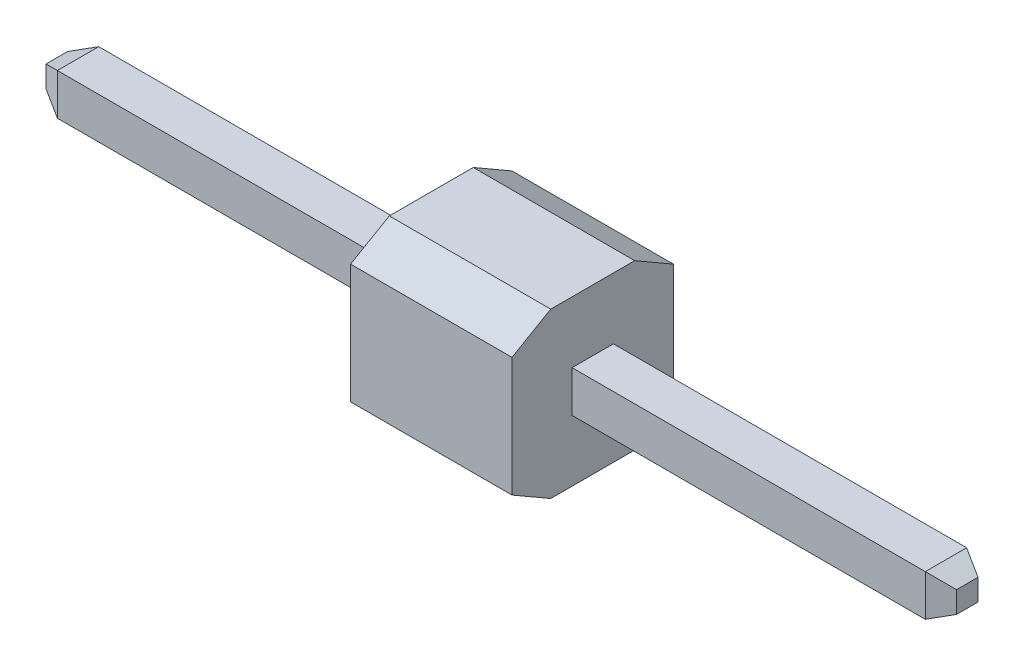
ISO-10303-21;
HEADER;
FILE_DESCRIPTION(('STEP AP214'),'2;1');
FILE_NAME('part.step','',(''),(''),'','','');
FILE_SCHEMA(('AUTOMOTIVE_DESIGN { 1 0 10303 214 1 1 1 1 }'));
ENDSEC;
DATA;
#1=APPLICATION_CONTEXT('core data for automotive mechanical design processes');
#2=APPLICATION_PROTOCOL_DEFINITION('international standard','automotive_design',2000,#1);
#3=PRODUCT_CONTEXT('',#1,'mechanical');
#4=PRODUCT('Part','Part','',(#3));
#5=PRODUCT_RELATED_PRODUCT_CATEGORY('part','',(#4));
#6=PRODUCT_DEFINITION_FORMATION('','',#4);
#7=PRODUCT_DEFINITION_CONTEXT('part definition',#1,'design');
#8=PRODUCT_DEFINITION('design','',#6,#7);
#9=PRODUCT_DEFINITION_SHAPE('','',#8);
#10=(LENGTH_UNIT() NAMED_UNIT(*) SI_UNIT(.MILLI.,.METRE.));
#11=(NAMED_UNIT(*) PLANE_ANGLE_UNIT() SI_UNIT($,.RADIAN.));
#12=(NAMED_UNIT(*) SI_UNIT($,.STERADIAN.) SOLID_ANGLE_UNIT());
#13=UNCERTAINTY_MEASURE_WITH_UNIT(LENGTH_MEASURE(1.E-05),#10,'distance_accuracy_value','');
#14=(GEOMETRIC_REPRESENTATION_CONTEXT(3) GLOBAL_UNCERTAINTY_ASSIGNED_CONTEXT((#13)) GLOBAL_UNIT_ASSIGNED_CONTEXT((#10,
#11,#12)) REPRESENTATION_CONTEXT('',''));
#15=CARTESIAN_POINT('',(0.,0.,0.));
#16=DIRECTION('',(0.,0.,1.));
#17=DIRECTION('',(1.,0.,0.));
#18=AXIS2_PLACEMENT_3D('',#15,#16,#17);
#19=CARTESIAN_POINT('',(5.42104959487915,12.3828717370861,0.629998634255617));
#20=DIRECTION('',(1.,4.37113882867379E-08,-4.37113882867379E-08));
#21=DIRECTION('',(-4.37113882867379E-08,1.,0.));
#22=AXIS2_PLACEMENT_3D('',#19,#20,#21);
#23=PLANE('',#22);
#24=DIRECTION('',(1.59994790123753E-08,0.50000000000019,0.866025403784329));
#25=VECTOR('',#24,1.);
#26=CARTESIAN_POINT('',(5.42104947189323,13.6264615755721,-0.940001365744382));
#27=LINE('',#26,#25);
#28=CARTESIAN_POINT('',(5.42104947189323,13.6264615755721,-0.940001365744382));
#29=VERTEX_POINT('',#28);
#30=CARTESIAN_POINT('',(5.421049482978,13.9728717370861,-0.340001365744383));
#31=VERTEX_POINT('',#30);
#32=EDGE_CURVE('E11',#29,#31,#27,.T.);
#33=ORIENTED_EDGE('',*,*,#32,.T.);
#34=DIRECTION('',(4.37113886966664E-08,0.,0.999999999999999));
#35=VECTOR('',#34,1.);
#36=CARTESIAN_POINT('',(5.421049482978,13.9728717370861,-0.340001365744383));
#37=LINE('',#36,#35);
#38=CARTESIAN_POINT('',(5.4210495398028,13.9728717370861,0.959998634255618));
#39=VERTEX_POINT('',#38);
#40=EDGE_CURVE('E304',#31,#39,#37,.T.);
#41=ORIENTED_EDGE('',*,*,#40,.T.);
#42=DIRECTION('',(5.97108656004285E-08,-0.500000000000188,0.866025403784328));
#43=VECTOR('',#42,1.);
#44=CARTESIAN_POINT('',(5.4210495398028,13.9728717370861,0.959998634255618));
#45=LINE('',#44,#43);
#46=CARTESIAN_POINT('',(5.4210495811717,13.6264615755721,1.55999863425562));
#47=VERTEX_POINT('',#46);
#48=EDGE_CURVE('E296',#39,#47,#45,.T.);
#49=ORIENTED_EDGE('',*,*,#48,.T.);
#50=DIRECTION('',(4.37113884815071E-08,-0.999999999999999,0.));
#51=VECTOR('',#50,1.);
#52=CARTESIAN_POINT('',(5.4210495811717,13.6264615755721,1.55999863425562));
#53=LINE('',#52,#51);
#54=CARTESIAN_POINT('',(5.42104966191449,11.7792818986001,1.55999863425562));
#55=VERTEX_POINT('',#54);
#56=EDGE_CURVE('E281',#47,#55,#53,.T.);
#57=ORIENTED_EDGE('',*,*,#56,.T.);
#58=DIRECTION('',(1.59994777304001E-08,0.50000000000019,0.866025403784329));
#59=VECTOR('',#58,1.);
#60=CARTESIAN_POINT('',(5.42104965082973,11.4328717370861,0.959998634255618));
#61=LINE('',#60,#59);
#62=CARTESIAN_POINT('',(5.42104965082973,11.4328717370861,0.959998634255618));
#63=VERTEX_POINT('',#62);
#64=EDGE_CURVE('E265',#63,#55,#61,.T.);
#65=ORIENTED_EDGE('',*,*,#64,.F.);
#66=DIRECTION('',(4.37113886966664E-08,0.,0.999999999999999));
#67=VECTOR('',#66,1.);
#68=CARTESIAN_POINT('',(5.42104959400492,11.4328717370861,-0.340001365744383));
#69=LINE('',#68,#67);
#70=CARTESIAN_POINT('',(5.42104959400492,11.4328717370861,-0.340001365744383));
#71=VERTEX_POINT('',#70);
#72=EDGE_CURVE('E248',#71,#63,#69,.T.);
#73=ORIENTED_EDGE('',*,*,#72,.F.);
#74=DIRECTION('',(5.97108668824036E-08,-0.500000000000188,0.866025403784328));
#75=VECTOR('',#74,1.);
#76=CARTESIAN_POINT('',(5.42104955263602,11.7792818986001,-0.940001365744382));
#77=LINE('',#76,#75);
#78=CARTESIAN_POINT('',(5.42104955263602,11.7792818986001,-0.940001365744382));
#79=VERTEX_POINT('',#78);
#80=EDGE_CURVE('E242',#79,#71,#77,.T.);
#81=ORIENTED_EDGE('',*,*,#80,.F.);
#82=DIRECTION('',(4.37113884815071E-08,-0.999999999999999,0.));
#83=VECTOR('',#82,1.);
#84=CARTESIAN_POINT('',(5.42104947189323,13.6264615755721,-0.940001365744382));
#85=LINE('',#84,#83);
#86=EDGE_CURVE('E236',#29,#79,#85,.T.);
#87=ORIENTED_EDGE('',*,*,#86,.F.);
#88=EDGE_LOOP('',(#33,#41,#49,#57,#65,#73,#81,#87));
#89=FACE_BOUND('',#88,.T.);
#90=DIRECTION('',(-4.37113900630947E-08,0.,-0.999999999999999));
#91=VECTOR('',#90,1.);
#92=CARTESIAN_POINT('',(5.42104956690386,13.0228717370861,0.629998634255617));
#93=LINE('',#92,#91);
#94=CARTESIAN_POINT('',(5.42104956690386,13.0228717370861,0.629998634255617));
#95=VERTEX_POINT('',#94);
#96=CARTESIAN_POINT('',(5.42104953892857,13.0228717370861,-0.0100013657443826));
#97=VERTEX_POINT('',#96);
#98=EDGE_CURVE('E302',#95,#97,#93,.T.);
#99=ORIENTED_EDGE('',*,*,#98,.T.);
#100=DIRECTION('',(-4.37113900630947E-08,0.999999999999999,0.));
#101=VECTOR('',#100,1.);
#102=CARTESIAN_POINT('',(5.42104956690386,12.3828717370861,-0.0100013657443826));
#103=LINE('',#102,#101);
#104=CARTESIAN_POINT('',(5.42104956690386,12.3828717370861,-0.0100013657443826));
#105=VERTEX_POINT('',#104);
#106=EDGE_CURVE('E293',#105,#97,#103,.T.);
#107=ORIENTED_EDGE('',*,*,#106,.F.);
#108=DIRECTION('',(-4.37113872875372E-08,0.,-0.999999999999999));
#109=VECTOR('',#108,1.);
#110=CARTESIAN_POINT('',(5.42104959487915,12.3828717370861,0.629998634255617));
#111=LINE('',#110,#109);
#112=CARTESIAN_POINT('',(5.42104959487915,12.3828717370861,0.629998634255617));
#113=VERTEX_POINT('',#112);
#114=EDGE_CURVE('E278',#113,#105,#111,.T.);
#115=ORIENTED_EDGE('',*,*,#114,.F.);
#116=DIRECTION('',(-4.37113872875371E-08,0.999999999999999,0.));
#117=VECTOR('',#116,1.);
#118=CARTESIAN_POINT('',(5.42104959487915,12.3828717370861,0.629998634255617));
#119=LINE('',#118,#117);
#120=EDGE_CURVE('E263',#113,#95,#119,.T.);
#121=ORIENTED_EDGE('',*,*,#120,.T.);
#122=EDGE_LOOP('',(#99,#107,#115,#121));
#123=FACE_BOUND('',#122,.T.);
#124=ADVANCED_FACE('F17',(#89,#123),#23,.T.);
#125=CARTESIAN_POINT('',(2.92104959487915,12.3828716278076,0.629998743534088));
#126=DIRECTION('',(1.,4.37113882867379E-08,-4.37113882867379E-08));
#127=DIRECTION('',(-4.37113882867379E-08,1.,0.));
#128=AXIS2_PLACEMENT_3D('',#125,#126,#127);
#129=PLANE('',#128);
#130=DIRECTION('',(1.59994783713877E-08,0.50000000000019,0.866025403784329));
#131=VECTOR('',#130,1.);
#132=CARTESIAN_POINT('',(2.92104947189323,13.6264614662936,-0.940001256465912));
#133=LINE('',#132,#131);
#134=CARTESIAN_POINT('',(2.92104947189323,13.6264614662936,-0.940001256465912));
#135=VERTEX_POINT('',#134);
#136=CARTESIAN_POINT('',(2.921049482978,13.9728716278076,-0.340001256465912));
#137=VERTEX_POINT('',#136);
#138=EDGE_CURVE('E24',#135,#137,#133,.T.);
#139=ORIENTED_EDGE('',*,*,#138,.F.);
#140=DIRECTION('',(4.37113882410924E-08,-0.999999999999999,0.));
#141=VECTOR('',#140,1.);
#142=CARTESIAN_POINT('',(2.92104947189323,13.6264614662936,-0.940001256465912));
#143=LINE('',#142,#141);
#144=CARTESIAN_POINT('',(2.92104955263602,11.7792817893216,-0.940001256465912));
#145=VERTEX_POINT('',#144);
#146=EDGE_CURVE('E300',#135,#145,#143,.T.);
#147=ORIENTED_EDGE('',*,*,#146,.T.);
#148=DIRECTION('',(5.97108668824036E-08,-0.500000000000188,0.866025403784328));
#149=VECTOR('',#148,1.);
#150=CARTESIAN_POINT('',(2.92104955263602,11.7792817893216,-0.940001256465912));
#151=LINE('',#150,#149);
#152=CARTESIAN_POINT('',(2.92104959400492,11.4328716278076,-0.340001256465912));
#153=VERTEX_POINT('',#152);
#154=EDGE_CURVE('E286',#145,#153,#151,.T.);
#155=ORIENTED_EDGE('',*,*,#154,.T.);
#156=DIRECTION('',(4.37113883550593E-08,0.,0.999999999999999));
#157=VECTOR('',#156,1.);
#158=CARTESIAN_POINT('',(2.92104959400492,11.4328716278076,-0.340001256465912));
#159=LINE('',#158,#157);
#160=CARTESIAN_POINT('',(2.92104965082973,11.4328716278076,0.959998743534088));
#161=VERTEX_POINT('',#160);
#162=EDGE_CURVE('E271',#153,#161,#159,.T.);
#163=ORIENTED_EDGE('',*,*,#162,.T.);
#164=DIRECTION('',(1.59994783713877E-08,0.50000000000019,0.866025403784329));
#165=VECTOR('',#164,1.);
#166=CARTESIAN_POINT('',(2.92104965082973,11.4328716278076,0.959998743534088));
#167=LINE('',#166,#165);
#168=CARTESIAN_POINT('',(2.92104966191449,11.7792817893216,1.55999874353409));
#169=VERTEX_POINT('',#168);
#170=EDGE_CURVE('E253',#161,#169,#167,.T.);
#171=ORIENTED_EDGE('',*,*,#170,.T.);
#172=DIRECTION('',(4.37113882410924E-08,-0.999999999999999,0.));
#173=VECTOR('',#172,1.);
#174=CARTESIAN_POINT('',(2.9210495811717,13.6264614662936,1.55999874353409));
#175=LINE('',#174,#173);
#176=CARTESIAN_POINT('',(2.9210495811717,13.6264614662936,1.55999874353409));
#177=VERTEX_POINT('',#176);
#178=EDGE_CURVE('E261',#177,#169,#175,.T.);
#179=ORIENTED_EDGE('',*,*,#178,.F.);
#180=DIRECTION('',(5.97108668824036E-08,-0.500000000000188,0.866025403784328));
#181=VECTOR('',#180,1.);
#182=CARTESIAN_POINT('',(2.9210495398028,13.9728716278076,0.959998743534088));
#183=LINE('',#182,#181);
#184=CARTESIAN_POINT('',(2.9210495398028,13.9728716278076,0.959998743534088));
#185=VERTEX_POINT('',#184);
#186=EDGE_CURVE('E276',#185,#177,#183,.T.);
#187=ORIENTED_EDGE('',*,*,#186,.F.);
#188=DIRECTION('',(4.37113883550593E-08,0.,0.999999999999999));
#189=VECTOR('',#188,1.);
#190=CARTESIAN_POINT('',(2.921049482978,13.9728716278076,-0.340001256465912));
#191=LINE('',#190,#189);
#192=EDGE_CURVE('E291',#137,#185,#191,.T.);
#193=ORIENTED_EDGE('',*,*,#192,.F.);
#194=EDGE_LOOP('',(#139,#147,#155,#163,#171,#179,#187,#193));
#195=FACE_BOUND('',#194,.T.);
#196=DIRECTION('',(-4.37113886753159E-08,0.999999999999999,0.));
#197=VECTOR('',#196,1.);
#198=CARTESIAN_POINT('',(2.92104956690386,12.3828716278076,-0.0100012564659119));
#199=LINE('',#198,#197);
#200=CARTESIAN_POINT('',(2.92104956690386,12.3828716278076,-0.0100012564659119));
#201=VERTEX_POINT('',#200);
#202=CARTESIAN_POINT('',(2.92104953892857,13.0228716278076,-0.0100012564659119));
#203=VERTEX_POINT('',#202);
#204=EDGE_CURVE('E298',#201,#203,#199,.T.);
#205=ORIENTED_EDGE('',*,*,#204,.T.);
#206=DIRECTION('',(-4.37113886753159E-08,0.,-0.999999999999999));
#207=VECTOR('',#206,1.);
#208=CARTESIAN_POINT('',(2.92104956690386,13.0228716278076,0.629998743534088));
#209=LINE('',#208,#207);
#210=CARTESIAN_POINT('',(2.92104956690386,13.0228716278076,0.629998743534088));
#211=VERTEX_POINT('',#210);
#212=EDGE_CURVE('E283',#211,#203,#209,.T.);
#213=ORIENTED_EDGE('',*,*,#212,.F.);
#214=DIRECTION('',(-4.37113879814265E-08,0.999999999999999,0.));
#215=VECTOR('',#214,1.);
#216=CARTESIAN_POINT('',(2.92104959487915,12.3828716278076,0.629998743534088));
#217=LINE('',#216,#215);
#218=CARTESIAN_POINT('',(2.92104959487915,12.3828716278076,0.629998743534088));
#219=VERTEX_POINT('',#218);
#220=EDGE_CURVE('E268',#219,#211,#217,.T.);
#221=ORIENTED_EDGE('',*,*,#220,.F.);
#222=DIRECTION('',(-4.37113879814266E-08,0.,-0.999999999999999));
#223=VECTOR('',#222,1.);
#224=CARTESIAN_POINT('',(2.92104959487915,12.3828716278076,0.629998743534088));
#225=LINE('',#224,#223);
#226=EDGE_CURVE('E251',#219,#201,#225,.T.);
#227=ORIENTED_EDGE('',*,*,#226,.T.);
#228=EDGE_LOOP('',(#205,#213,#221,#227));
#229=FACE_BOUND('',#228,.T.);
#230=ADVANCED_FACE('F314',(#195,#229),#129,.F.);
#231=CARTESIAN_POINT('',(5.42104947189323,13.6264615755721,-0.940001365744382));
#232=DIRECTION('',(5.97108668343731E-08,-0.866025403784328,0.50000000000019));
#233=DIRECTION('',(-1.59994785476185E-08,-0.500000000000192,-0.866025403784329));
#234=AXIS2_PLACEMENT_3D('',#231,#232,#233);
#235=PLANE('',#234);
#236=ORIENTED_EDGE('',*,*,#138,.T.);
#237=DIRECTION('',(-0.999999999999998,-4.37113882867378E-08,4.37113883755557E-08));
#238=VECTOR('',#237,1.);
#239=CARTESIAN_POINT('',(5.421049482978,13.9728717370861,-0.340001365744383));
#240=LINE('',#239,#238);
#241=EDGE_CURVE('E288',#31,#137,#240,.T.);
#242=ORIENTED_EDGE('',*,*,#241,.F.);
#243=ORIENTED_EDGE('',*,*,#32,.F.);
#244=DIRECTION('',(-0.999999999999998,-4.37113882867378E-08,4.37113881091022E-08));
#245=VECTOR('',#244,1.);
#246=CARTESIAN_POINT('',(5.42104947189323,13.6264615755721,-0.940001365744382));
#247=LINE('',#246,#245);
#248=EDGE_CURVE('E256',#29,#135,#247,.T.);
#249=ORIENTED_EDGE('',*,*,#248,.T.);
#250=EDGE_LOOP('',(#236,#242,#243,#249));
#251=FACE_BOUND('',#250,.T.);
#252=ADVANCED_FACE('F306',(#251),#235,.F.);
#253=CARTESIAN_POINT('',(5.421049482978,13.9728717370861,-0.340001365744383));
#254=DIRECTION('',(4.37113882867379E-08,-1.,0.));
#255=DIRECTION('',(1.,4.37113882867379E-08,-4.37113882867379E-08));
#256=AXIS2_PLACEMENT_3D('',#253,#254,#255);
#257=PLANE('',#256);
#258=ORIENTED_EDGE('',*,*,#192,.T.);
#259=DIRECTION('',(-0.999999999999998,-4.37113882867378E-08,4.37113882867378E-08));
#260=VECTOR('',#259,1.);
#261=CARTESIAN_POINT('',(5.4210495398028,13.9728717370861,0.959998634255618));
#262=LINE('',#261,#260);
#263=EDGE_CURVE('E273',#39,#185,#262,.T.);
#264=ORIENTED_EDGE('',*,*,#263,.F.);
#265=ORIENTED_EDGE('',*,*,#40,.F.);
#266=ORIENTED_EDGE('',*,*,#241,.T.);
#267=EDGE_LOOP('',(#258,#264,#265,#266));
#268=FACE_BOUND('',#267,.T.);
#269=ADVANCED_FACE('F311',(#268),#257,.F.);
#270=CARTESIAN_POINT('',(5.4210495398028,13.9728717370861,0.959998634255618));
#271=DIRECTION('',(1.59994785476185E-08,-0.86602540378433,-0.50000000000019));
#272=DIRECTION('',(-5.97108668343731E-08,0.500000000000188,-0.866025403784329));
#273=AXIS2_PLACEMENT_3D('',#270,#271,#272);
#274=PLANE('',#273);
#275=ORIENTED_EDGE('',*,*,#186,.T.);
#276=DIRECTION('',(-0.999999999999998,-4.37113882867378E-08,4.37113882867378E-08));
#277=VECTOR('',#276,1.);
#278=CARTESIAN_POINT('',(5.4210495811717,13.6264615755721,1.55999863425562));
#279=LINE('',#278,#277);
#280=EDGE_CURVE('E258',#47,#177,#279,.T.);
#281=ORIENTED_EDGE('',*,*,#280,.F.);
#282=ORIENTED_EDGE('',*,*,#48,.F.);
#283=ORIENTED_EDGE('',*,*,#263,.T.);
#284=EDGE_LOOP('',(#275,#281,#282,#283));
#285=FACE_BOUND('',#284,.T.);
#286=ADVANCED_FACE('F319',(#285),#274,.F.);
#287=CARTESIAN_POINT('',(5.4210495811717,13.6264615755721,1.55999863425562));
#288=DIRECTION('',(-4.37113882867379E-08,0.,-1.));
#289=DIRECTION('',(-1.,-4.37113882867379E-08,4.37113882867379E-08));
#290=AXIS2_PLACEMENT_3D('',#287,#288,#289);
#291=PLANE('',#290);
#292=ORIENTED_EDGE('',*,*,#178,.T.);
#293=DIRECTION('',(-0.999999999999998,-4.37113882867378E-08,4.37113882867378E-08));
#294=VECTOR('',#293,1.);
#295=CARTESIAN_POINT('',(5.42104966191449,11.7792818986001,1.55999863425562));
#296=LINE('',#295,#294);
#297=EDGE_CURVE('E245',#55,#169,#296,.T.);
#298=ORIENTED_EDGE('',*,*,#297,.F.);
#299=ORIENTED_EDGE('',*,*,#56,.F.);
#300=ORIENTED_EDGE('',*,*,#280,.T.);
#301=EDGE_LOOP('',(#292,#298,#299,#300));
#302=FACE_BOUND('',#301,.T.);
#303=ADVANCED_FACE('F326',(#302),#291,.F.);
#304=CARTESIAN_POINT('',(5.42104965082973,11.4328717370861,0.959998634255618));
#305=DIRECTION('',(5.97108668343731E-08,-0.866025403784328,0.50000000000019));
#306=DIRECTION('',(-1.59994785476185E-08,-0.500000000000192,-0.866025403784329));
#307=AXIS2_PLACEMENT_3D('',#304,#305,#306);
#308=PLANE('',#307);
#309=ORIENTED_EDGE('',*,*,#170,.F.);
#310=DIRECTION('',(-0.999999999999998,-4.37113882867378E-08,4.37113882867378E-08));
#311=VECTOR('',#310,1.);
#312=CARTESIAN_POINT('',(5.42104965082973,11.4328717370861,0.959998634255618));
#313=LINE('',#312,#311);
#314=EDGE_CURVE('E239',#63,#161,#313,.T.);
#315=ORIENTED_EDGE('',*,*,#314,.F.);
#316=ORIENTED_EDGE('',*,*,#64,.T.);
#317=ORIENTED_EDGE('',*,*,#297,.T.);
#318=EDGE_LOOP('',(#309,#315,#316,#317));
#319=FACE_BOUND('',#318,.T.);
#320=ADVANCED_FACE('F329',(#319),#308,.T.);
#321=CARTESIAN_POINT('',(5.42104959400492,11.4328717370861,-0.340001365744383));
#322=DIRECTION('',(4.37113882867379E-08,-1.,0.));
#323=DIRECTION('',(1.,4.37113882867379E-08,-4.37113882867379E-08));
#324=AXIS2_PLACEMENT_3D('',#321,#322,#323);
#325=PLANE('',#324);
#326=ORIENTED_EDGE('',*,*,#162,.F.);
#327=DIRECTION('',(-0.999999999999998,-4.37113889972806E-08,4.37113883755557E-08));
#328=VECTOR('',#327,1.);
#329=CARTESIAN_POINT('',(5.42104959400492,11.4328717370861,-0.340001365744383));
#330=LINE('',#329,#328);
#331=EDGE_CURVE('E233',#71,#153,#330,.T.);
#332=ORIENTED_EDGE('',*,*,#331,.F.);
#333=ORIENTED_EDGE('',*,*,#72,.T.);
#334=ORIENTED_EDGE('',*,*,#314,.T.);
#335=EDGE_LOOP('',(#326,#332,#333,#334));
#336=FACE_BOUND('',#335,.T.);
#337=ADVANCED_FACE('F333',(#336),#325,.T.);
#338=CARTESIAN_POINT('',(5.42104955263602,11.7792818986001,-0.940001365744382));
#339=DIRECTION('',(1.59994785476185E-08,-0.86602540378433,-0.50000000000019));
#340=DIRECTION('',(-5.97108668343731E-08,0.500000000000188,-0.866025403784329));
#341=AXIS2_PLACEMENT_3D('',#338,#339,#340);
#342=PLANE('',#341);
#343=ORIENTED_EDGE('',*,*,#154,.F.);
#344=DIRECTION('',(-0.999999999999998,-4.37113882867378E-08,4.37113881091022E-08));
#345=VECTOR('',#344,1.);
#346=CARTESIAN_POINT('',(5.42104955263602,11.7792818986001,-0.940001365744382));
#347=LINE('',#346,#345);
#348=EDGE_CURVE('E230',#79,#145,#347,.T.);
#349=ORIENTED_EDGE('',*,*,#348,.F.);
#350=ORIENTED_EDGE('',*,*,#80,.T.);
#351=ORIENTED_EDGE('',*,*,#331,.T.);
#352=EDGE_LOOP('',(#343,#349,#350,#351));
#353=FACE_BOUND('',#352,.T.);
#354=ADVANCED_FACE('F337',(#353),#342,.T.);
#355=CARTESIAN_POINT('',(5.42104947189323,13.6264615755721,-0.940001365744382));
#356=DIRECTION('',(-4.37113882867379E-08,0.,-1.));
#357=DIRECTION('',(-4.37113882867379E-08,1.,0.));
#358=AXIS2_PLACEMENT_3D('',#355,#356,#357);
#359=PLANE('',#358);
#360=ORIENTED_EDGE('',*,*,#146,.F.);
#361=ORIENTED_EDGE('',*,*,#248,.F.);
#362=ORIENTED_EDGE('',*,*,#86,.T.);
#363=ORIENTED_EDGE('',*,*,#348,.T.);
#364=EDGE_LOOP('',(#360,#361,#362,#363));
#365=FACE_BOUND('',#364,.T.);
#366=ADVANCED_FACE('F339',(#365),#359,.T.);
#367=CARTESIAN_POINT('',(-2.87895040512085,12.3828713742816,0.62999899706014));
#368=DIRECTION('',(-1.,-4.37113882867379E-08,4.37113882867379E-08));
#369=DIRECTION('',(4.37113882867379E-08,-1.,0.));
#370=AXIS2_PLACEMENT_3D('',#367,#368,#369);
#371=PLANE('',#370);
#372=DIRECTION('',(4.37113927480282E-08,-0.999999999999999,0.));
#373=VECTOR('',#372,1.);
#374=CARTESIAN_POINT('',(-2.87895044761868,12.8689898470906,0.14388052425114));
#375=LINE('',#374,#373);
#376=CARTESIAN_POINT('',(-2.87895044761868,12.8689898470906,0.14388052425114));
#377=VERTEX_POINT('',#376);
#378=CARTESIAN_POINT('',(-2.87895043309614,12.5367529014726,0.14388052425114));
#379=VERTEX_POINT('',#378);
#380=EDGE_CURVE('E228',#377,#379,#375,.T.);
#381=ORIENTED_EDGE('',*,*,#380,.T.);
#382=DIRECTION('',(4.37113900746999E-08,0.,0.999999999999999));
#383=VECTOR('',#382,1.);
#384=CARTESIAN_POINT('',(-2.87895043309614,12.5367529014726,0.14388052425114));
#385=LINE('',#384,#383);
#386=CARTESIAN_POINT('',(-2.8789504185736,12.5367529014726,0.47611746986914));
#387=VERTEX_POINT('',#386);
#388=EDGE_CURVE('E223',#379,#387,#385,.T.);
#389=ORIENTED_EDGE('',*,*,#388,.T.);
#390=DIRECTION('',(-4.37113847280434E-08,0.999999999999999,0.));
#391=VECTOR('',#390,1.);
#392=CARTESIAN_POINT('',(-2.8789504185736,12.5367529014726,0.47611746986914));
#393=LINE('',#392,#391);
#394=CARTESIAN_POINT('',(-2.87895043309614,12.8689898470906,0.47611746986914));
#395=VERTEX_POINT('',#394);
#396=EDGE_CURVE('E215',#387,#395,#393,.T.);
#397=ORIENTED_EDGE('',*,*,#396,.T.);
#398=DIRECTION('',(-4.37113820547151E-08,0.,-0.999999999999999));
#399=VECTOR('',#398,1.);
#400=CARTESIAN_POINT('',(-2.87895043309614,12.8689898470906,0.47611746986914));
#401=LINE('',#400,#399);
#402=EDGE_CURVE('E207',#395,#377,#401,.T.);
#403=ORIENTED_EDGE('',*,*,#402,.T.);
#404=EDGE_LOOP('',(#381,#389,#397,#403));
#405=FACE_BOUND('',#404,.T.);
#406=ADVANCED_FACE('F341',(#405),#371,.T.);
#407=CARTESIAN_POINT('',(-2.87895040512085,12.3828713742816,0.62999899706014));
#408=DIRECTION('',(4.37113882867379E-08,-1.,0.));
#409=DIRECTION('',(-4.37113882867379E-08,0.,-1.));
#410=AXIS2_PLACEMENT_3D('',#407,#408,#409);
#411=PLANE('',#410);
#412=DIRECTION('',(0.999999999999998,4.37113881958092E-08,-4.37113882769955E-08));
#413=VECTOR('',#412,1.);
#414=CARTESIAN_POINT('',(-2.54895040512085,12.3828713887063,0.629998982635382));
#415=LINE('',#414,#413);
#416=CARTESIAN_POINT('',(-2.54895040512085,12.3828713887063,0.629998982635382));
#417=VERTEX_POINT('',#416);
#418=EDGE_CURVE('E225',#417,#219,#415,.T.);
#419=ORIENTED_EDGE('',*,*,#418,.F.);
#420=DIRECTION('',(-4.37113886753159E-08,0.,-0.999999999999999));
#421=VECTOR('',#420,1.);
#422=CARTESIAN_POINT('',(-2.54895040512085,12.3828713887063,0.629998982635382));
#423=LINE('',#422,#421);
#424=CARTESIAN_POINT('',(-2.54895043309614,12.3828713887063,-0.010001017364618));
#425=VERTEX_POINT('',#424);
#426=EDGE_CURVE('E217',#417,#425,#423,.T.);
#427=ORIENTED_EDGE('',*,*,#426,.T.);
#428=DIRECTION('',(0.999999999999998,4.37113881958092E-08,-4.37113882161057E-08));
#429=VECTOR('',#428,1.);
#430=CARTESIAN_POINT('',(-2.54895043309614,12.3828713887063,-0.010001017364618));
#431=LINE('',#430,#429);
#432=EDGE_CURVE('E220',#425,#201,#431,.T.);
#433=ORIENTED_EDGE('',*,*,#432,.T.);
#434=ORIENTED_EDGE('',*,*,#226,.F.);
#435=EDGE_LOOP('',(#419,#427,#433,#434));
#436=FACE_BOUND('',#435,.T.);
#437=ADVANCED_FACE('F348',(#436),#411,.T.);
#438=CARTESIAN_POINT('',(-2.87895043309614,12.3828713742816,-0.0100010029398598));
#439=DIRECTION('',(-4.37113882867379E-08,0.,-1.));
#440=DIRECTION('',(-1.,-4.37113882867379E-08,4.37113882867379E-08));
#441=AXIS2_PLACEMENT_3D('',#438,#439,#440);
#442=PLANE('',#441);
#443=ORIENTED_EDGE('',*,*,#432,.F.);
#444=DIRECTION('',(-4.37113872875371E-08,0.999999999999999,0.));
#445=VECTOR('',#444,1.);
#446=CARTESIAN_POINT('',(-2.54895043309614,12.3828713887063,-0.010001017364618));
#447=LINE('',#446,#445);
#448=CARTESIAN_POINT('',(-2.54895046107143,13.0228713887063,-0.010001017364618));
#449=VERTEX_POINT('',#448);
#450=EDGE_CURVE('E209',#425,#449,#447,.T.);
#451=ORIENTED_EDGE('',*,*,#450,.T.);
#452=DIRECTION('',(0.999999999999998,4.37113881958092E-08,-4.37113882161058E-08));
#453=VECTOR('',#452,1.);
#454=CARTESIAN_POINT('',(-2.54895046107143,13.0228713887063,-0.010001017364618));
#455=LINE('',#454,#453);
#456=EDGE_CURVE('E212',#449,#203,#455,.T.);
#457=ORIENTED_EDGE('',*,*,#456,.T.);
#458=ORIENTED_EDGE('',*,*,#204,.F.);
#459=EDGE_LOOP('',(#443,#451,#457,#458));
#460=FACE_BOUND('',#459,.T.);
#461=ADVANCED_FACE('F424',(#460),#442,.T.);
#462=CARTESIAN_POINT('',(-2.87895043309614,13.0228713742816,0.62999899706014));
#463=DIRECTION('',(4.37113882867379E-08,-1.,0.));
#464=DIRECTION('',(-4.37113882867379E-08,0.,-1.));
#465=AXIS2_PLACEMENT_3D('',#462,#463,#464);
#466=PLANE('',#465);
#467=ORIENTED_EDGE('',*,*,#456,.F.);
#468=DIRECTION('',(4.37113886753159E-08,0.,0.999999999999999));
#469=VECTOR('',#468,1.);
#470=CARTESIAN_POINT('',(-2.54895046107143,13.0228713887063,-0.010001017364618));
#471=LINE('',#470,#469);
#472=CARTESIAN_POINT('',(-2.54895043309614,13.0228713887063,0.629998982635382));
#473=VERTEX_POINT('',#472);
#474=EDGE_CURVE('E201',#449,#473,#471,.T.);
#475=ORIENTED_EDGE('',*,*,#474,.T.);
#476=DIRECTION('',(0.999999999999998,4.37113885205545E-08,-4.37113882769955E-08));
#477=VECTOR('',#476,1.);
#478=CARTESIAN_POINT('',(-2.54895043309614,13.0228713887063,0.629998982635382));
#479=LINE('',#478,#477);
#480=EDGE_CURVE('E204',#473,#211,#479,.T.);
#481=ORIENTED_EDGE('',*,*,#480,.T.);
#482=ORIENTED_EDGE('',*,*,#212,.T.);
#483=EDGE_LOOP('',(#467,#475,#481,#482));
#484=FACE_BOUND('',#483,.T.);
#485=ADVANCED_FACE('F421',(#484),#466,.F.);
#486=CARTESIAN_POINT('',(-2.87895040512085,12.3828713742816,0.62999899706014));
#487=DIRECTION('',(-4.37113882867379E-08,0.,-1.));
#488=DIRECTION('',(-1.,-4.37113882867379E-08,4.37113882867379E-08));
#489=AXIS2_PLACEMENT_3D('',#486,#487,#488);
#490=PLANE('',#489);
#491=ORIENTED_EDGE('',*,*,#480,.F.);
#492=DIRECTION('',(4.37113900630948E-08,-0.999999999999999,0.));
#493=VECTOR('',#492,1.);
#494=CARTESIAN_POINT('',(-2.54895043309614,13.0228713887063,0.629998982635382));
#495=LINE('',#494,#493);
#496=EDGE_CURVE('E196',#473,#417,#495,.T.);
#497=ORIENTED_EDGE('',*,*,#496,.T.);
#498=ORIENTED_EDGE('',*,*,#418,.T.);
#499=ORIENTED_EDGE('',*,*,#220,.T.);
#500=EDGE_LOOP('',(#491,#497,#498,#499));
#501=FACE_BOUND('',#500,.T.);
#502=ADVANCED_FACE('F376',(#501),#490,.F.);
#503=CARTESIAN_POINT('',(-2.87895040512085,12.3828713742816,0.62999899706014));
#504=DIRECTION('',(-4.37113882867379E-08,0.,-1.));
#505=DIRECTION('',(-1.,-4.37113882867379E-08,4.37113882867379E-08));
#506=AXIS2_PLACEMENT_3D('',#503,#504,#505);
#507=PLANE('',#506);
#508=DIRECTION('',(0.999999999999998,4.37113881958092E-08,-4.37113882769955E-08));
#509=VECTOR('',#508,1.);
#510=CARTESIAN_POINT('',(5.42104959487915,12.3828717370861,0.629998634255617));
#511=LINE('',#510,#509);
#512=CARTESIAN_POINT('',(10.8910495948791,12.3828719761874,0.629998395154324));
#513=VERTEX_POINT('',#512);
#514=EDGE_CURVE('E199',#113,#513,#511,.T.);
#515=ORIENTED_EDGE('',*,*,#514,.T.);
#516=DIRECTION('',(-4.37113900630947E-08,0.999999999999999,0.));
#517=VECTOR('',#516,1.);
#518=CARTESIAN_POINT('',(10.8910495948791,12.3828719761874,0.629998395154324));
#519=LINE('',#518,#517);
#520=CARTESIAN_POINT('',(10.8910495669039,13.0228719761874,0.629998395154324));
#521=VERTEX_POINT('',#520);
#522=EDGE_CURVE('E191',#513,#521,#519,.T.);
#523=ORIENTED_EDGE('',*,*,#522,.T.);
#524=DIRECTION('',(0.999999999999998,4.37113878710639E-08,-4.37113882769955E-08));
#525=VECTOR('',#524,1.);
#526=CARTESIAN_POINT('',(5.42104956690386,13.0228717370861,0.629998634255617));
#527=LINE('',#526,#525);
#528=EDGE_CURVE('E194',#95,#521,#527,.T.);
#529=ORIENTED_EDGE('',*,*,#528,.F.);
#530=ORIENTED_EDGE('',*,*,#120,.F.);
#531=EDGE_LOOP('',(#515,#523,#529,#530));
#532=FACE_BOUND('',#531,.T.);
#533=ADVANCED_FACE('F367',(#532),#507,.F.);
#534=CARTESIAN_POINT('',(-2.87895043309614,13.0228713742816,0.62999899706014));
#535=DIRECTION('',(4.37113882867379E-08,-1.,0.));
#536=DIRECTION('',(-4.37113882867379E-08,0.,-1.));
#537=AXIS2_PLACEMENT_3D('',#534,#535,#536);
#538=PLANE('',#537);
#539=ORIENTED_EDGE('',*,*,#528,.T.);
#540=DIRECTION('',(-4.37113872875372E-08,0.,-0.999999999999999));
#541=VECTOR('',#540,1.);
#542=CARTESIAN_POINT('',(10.8910495669039,13.0228719761874,0.629998395154324));
#543=LINE('',#542,#541);
#544=CARTESIAN_POINT('',(10.8910495389286,13.0228719761874,-0.0100016048456765));
#545=VERTEX_POINT('',#544);
#546=EDGE_CURVE('E186',#521,#545,#543,.T.);
#547=ORIENTED_EDGE('',*,*,#546,.T.);
#548=DIRECTION('',(0.999999999999998,4.37113881958092E-08,-4.37113881146228E-08));
#549=VECTOR('',#548,1.);
#550=CARTESIAN_POINT('',(5.42104953892857,13.0228717370861,-0.0100013657443823));
#551=LINE('',#550,#549);
#552=EDGE_CURVE('E189',#97,#545,#551,.T.);
#553=ORIENTED_EDGE('',*,*,#552,.F.);
#554=ORIENTED_EDGE('',*,*,#98,.F.);
#555=EDGE_LOOP('',(#539,#547,#553,#554));
#556=FACE_BOUND('',#555,.T.);
#557=ADVANCED_FACE('F364',(#556),#538,.F.);
#558=CARTESIAN_POINT('',(-2.87895043309614,12.3828713742816,-0.0100010029398598));
#559=DIRECTION('',(-4.37113882867379E-08,0.,-1.));
#560=DIRECTION('',(-1.,-4.37113882867379E-08,4.37113882867379E-08));
#561=AXIS2_PLACEMENT_3D('',#558,#559,#560);
#562=PLANE('',#561);
#563=ORIENTED_EDGE('',*,*,#552,.T.);
#564=DIRECTION('',(4.37113872875372E-08,-0.999999999999999,0.));
#565=VECTOR('',#564,1.);
#566=CARTESIAN_POINT('',(10.8910495389286,13.0228719761874,-0.0100016048456764));
#567=LINE('',#566,#565);
#568=CARTESIAN_POINT('',(10.8910495669039,12.3828719761874,-0.0100016048456765));
#569=VERTEX_POINT('',#568);
#570=EDGE_CURVE('E176',#545,#569,#567,.T.);
#571=ORIENTED_EDGE('',*,*,#570,.T.);
#572=DIRECTION('',(0.999999999999998,4.37113885205545E-08,-4.37113881146229E-08));
#573=VECTOR('',#572,1.);
#574=CARTESIAN_POINT('',(5.42104956690386,12.3828717370861,-0.0100013657443823));
#575=LINE('',#574,#573);
#576=EDGE_CURVE('E179',#105,#569,#575,.T.);
#577=ORIENTED_EDGE('',*,*,#576,.F.);
#578=ORIENTED_EDGE('',*,*,#106,.T.);
#579=EDGE_LOOP('',(#563,#571,#577,#578));
#580=FACE_BOUND('',#579,.T.);
#581=ADVANCED_FACE('F366',(#580),#562,.T.);
#582=CARTESIAN_POINT('',(-2.87895040512085,12.3828713742816,0.62999899706014));
#583=DIRECTION('',(4.37113882867379E-08,-1.,0.));
#584=DIRECTION('',(-4.37113882867379E-08,0.,-1.));
#585=AXIS2_PLACEMENT_3D('',#582,#583,#584);
#586=PLANE('',#585);
#587=ORIENTED_EDGE('',*,*,#576,.T.);
#588=DIRECTION('',(4.37113845119796E-08,0.,0.999999999999999));
#589=VECTOR('',#588,1.);
#590=CARTESIAN_POINT('',(10.8910495669039,12.3828719761874,-0.0100016048456765));
#591=LINE('',#590,#589);
#592=EDGE_CURVE('E167',#569,#513,#591,.T.);
#593=ORIENTED_EDGE('',*,*,#592,.T.);
#594=ORIENTED_EDGE('',*,*,#514,.F.);
#595=ORIENTED_EDGE('',*,*,#114,.T.);
#596=EDGE_LOOP('',(#587,#593,#594,#595));
#597=FACE_BOUND('',#596,.T.);
#598=ADVANCED_FACE('F373',(#597),#586,.T.);
#599=CARTESIAN_POINT('',(11.2210495948792,12.3828719906121,0.629998380729565));
#600=DIRECTION('',(-1.,-4.37113882867379E-08,4.37113882867379E-08));
#601=DIRECTION('',(4.37113882867379E-08,-1.,0.));
#602=AXIS2_PLACEMENT_3D('',#599,#600,#601);
#603=PLANE('',#602);
#604=DIRECTION('',(-4.37113980946847E-08,0.999999999999999,0.));
#605=VECTOR('',#604,1.);
#606=CARTESIAN_POINT('',(11.2210495669039,12.5367535178031,0.143879907920565));
#607=LINE('',#606,#605);
#608=CARTESIAN_POINT('',(11.2210495669039,12.5367535178031,0.143879907920565));
#609=VERTEX_POINT('',#608);
#610=CARTESIAN_POINT('',(11.2210495523813,12.8689904634211,0.143879907920565));
#611=VERTEX_POINT('',#610);
#612=EDGE_CURVE('E153',#609,#611,#607,.T.);
#613=ORIENTED_EDGE('',*,*,#612,.T.);
#614=DIRECTION('',(4.37113927480282E-08,0.,0.999999999999999));
#615=VECTOR('',#614,1.);
#616=CARTESIAN_POINT('',(11.2210495523813,12.8689904634211,0.143879907920565));
#617=LINE('',#616,#615);
#618=CARTESIAN_POINT('',(11.2210495669039,12.8689904634211,0.476116853538565));
#619=VERTEX_POINT('',#618);
#620=EDGE_CURVE('E395',#611,#619,#617,.T.);
#621=ORIENTED_EDGE('',*,*,#620,.T.);
#622=DIRECTION('',(4.37113820547151E-08,-0.999999999999999,0.));
#623=VECTOR('',#622,1.);
#624=CARTESIAN_POINT('',(11.2210495669039,12.8689904634211,0.476116853538565));
#625=LINE('',#624,#623);
#626=CARTESIAN_POINT('',(11.2210495814264,12.5367535178031,0.476116853538565));
#627=VERTEX_POINT('',#626);
#628=EDGE_CURVE('E156',#619,#627,#625,.T.);
#629=ORIENTED_EDGE('',*,*,#628,.T.);
#630=DIRECTION('',(-4.37113927480282E-08,0.,-0.999999999999999));
#631=VECTOR('',#630,1.);
#632=CARTESIAN_POINT('',(11.2210495814264,12.5367535178031,0.476116853538565));
#633=LINE('',#632,#631);
#634=EDGE_CURVE('E149',#627,#609,#633,.T.);
#635=ORIENTED_EDGE('',*,*,#634,.T.);
#636=EDGE_LOOP('',(#613,#621,#629,#635));
#637=FACE_BOUND('',#636,.T.);
#638=ADVANCED_FACE('F151',(#637),#603,.F.);
#639=CARTESIAN_POINT('',(-2.87895042636976,12.8689898470906,0.62999899706014));
#640=DIRECTION('',(-0.422618301356784,0.906307768563367,1.84732310895534E-08));
#641=DIRECTION('',(4.37113882867379E-08,0.,1.));
#642=AXIS2_PLACEMENT_3D('',#639,#640,#641);
#643=PLANE('',#642);
#644=DIRECTION('',(0.834817095446927,0.389281657126016,-0.389281657126019));
#645=VECTOR('',#644,1.);
#646=CARTESIAN_POINT('',(-2.87895044761837,12.8689898470902,0.143880524251471));
#647=LINE('',#646,#645);
#648=EDGE_CURVE('E181',#377,#449,#647,.T.);
#649=ORIENTED_EDGE('',*,*,#648,.F.);
#650=ORIENTED_EDGE('',*,*,#402,.F.);
#651=DIRECTION('',(-0.834817129479006,-0.38928165712602,-0.389281584143987));
#652=VECTOR('',#651,1.);
#653=CARTESIAN_POINT('',(-2.54895043309592,13.0228713887061,0.629998982635147));
#654=LINE('',#653,#652);
#655=EDGE_CURVE('E404',#473,#395,#654,.T.);
#656=ORIENTED_EDGE('',*,*,#655,.F.);
#657=ORIENTED_EDGE('',*,*,#474,.F.);
#658=EDGE_LOOP('',(#649,#650,#656,#657));
#659=FACE_BOUND('',#658,.T.);
#660=ADVANCED_FACE('F418',(#659),#643,.T.);
#661=CARTESIAN_POINT('',(-2.87895041184722,12.3828713742816,0.47611746986914));
#662=DIRECTION('',(-0.422618222124841,-1.84732292043498E-08,0.906307805509828));
#663=DIRECTION('',(4.37113882867379E-08,-1.,0.));
#664=AXIS2_PLACEMENT_3D('',#661,#662,#663);
#665=PLANE('',#664);
#666=ORIENTED_EDGE('',*,*,#655,.T.);
#667=ORIENTED_EDGE('',*,*,#396,.F.);
#668=DIRECTION('',(-0.834817163511086,0.389281584143985,-0.389281584143989));
#669=VECTOR('',#668,1.);
#670=CARTESIAN_POINT('',(-2.54895040512068,12.3828713887065,0.629998982635199));
#671=LINE('',#670,#669);
#672=EDGE_CURVE('E160',#417,#387,#671,.T.);
#673=ORIENTED_EDGE('',*,*,#672,.F.);
#674=ORIENTED_EDGE('',*,*,#496,.F.);
#675=EDGE_LOOP('',(#666,#667,#673,#674));
#676=FACE_BOUND('',#675,.T.);
#677=ADVANCED_FACE('F434',(#676),#665,.T.);
#678=CARTESIAN_POINT('',(-2.54895043309614,12.3828713887063,-0.010001017364618));
#679=DIRECTION('',(0.422618301356784,1.8473232667688E-08,0.906307768563367));
#680=DIRECTION('',(-4.37113882867379E-08,1.,0.));
#681=AXIS2_PLACEMENT_3D('',#678,#679,#680);
#682=PLANE('',#681);
#683=ORIENTED_EDGE('',*,*,#648,.T.);
#684=ORIENTED_EDGE('',*,*,#450,.F.);
#685=DIRECTION('',(0.834817129479007,-0.389281584143988,-0.389281657126018));
#686=VECTOR('',#685,1.);
#687=CARTESIAN_POINT('',(-2.87895043309605,12.5367529014727,0.143880524251236));
#688=LINE('',#687,#686);
#689=EDGE_CURVE('E170',#379,#425,#688,.T.);
#690=ORIENTED_EDGE('',*,*,#689,.F.);
#691=ORIENTED_EDGE('',*,*,#380,.F.);
#692=EDGE_LOOP('',(#683,#684,#690,#691));
#693=FACE_BOUND('',#692,.T.);
#694=ADVANCED_FACE('F413',(#693),#682,.F.);
#695=CARTESIAN_POINT('',(-2.54895040512085,12.3828713887063,0.629998982635382));
#696=DIRECTION('',(0.422618222124841,0.906307805509828,-1.84732308250282E-08));
#697=DIRECTION('',(-4.37113882867379E-08,0.,-1.));
#698=AXIS2_PLACEMENT_3D('',#695,#696,#697);
#699=PLANE('',#698);
#700=ORIENTED_EDGE('',*,*,#672,.T.);
#701=ORIENTED_EDGE('',*,*,#388,.F.);
#702=ORIENTED_EDGE('',*,*,#689,.T.);
#703=ORIENTED_EDGE('',*,*,#426,.F.);
#704=EDGE_LOOP('',(#700,#701,#702,#703));
#705=FACE_BOUND('',#704,.T.);
#706=ADVANCED_FACE('F429',(#705),#699,.F.);
#707=CARTESIAN_POINT('',(11.2210495881528,12.5367535178031,0.629998380729565));
#708=DIRECTION('',(0.422618301356784,-0.906307768563367,-1.84732310470096E-08));
#709=DIRECTION('',(4.37113882867379E-08,0.,1.));
#710=AXIS2_PLACEMENT_3D('',#707,#708,#709);
#711=PLANE('',#710);
#712=DIRECTION('',(-0.834817129479006,-0.38928165712602,-0.389281584143987));
#713=VECTOR('',#712,1.);
#714=CARTESIAN_POINT('',(11.2210495669036,12.5367535178035,0.143879907920896));
#715=LINE('',#714,#713);
#716=EDGE_CURVE('E164',#609,#569,#715,.T.);
#717=ORIENTED_EDGE('',*,*,#716,.F.);
#718=ORIENTED_EDGE('',*,*,#634,.F.);
#719=DIRECTION('',(0.834817095446927,0.389281657126018,-0.389281657126017));
#720=VECTOR('',#719,1.);
#721=CARTESIAN_POINT('',(10.8910495948791,12.3828719761874,0.629998395154324));
#722=LINE('',#721,#720);
#723=EDGE_CURVE('E392',#513,#627,#722,.T.);
#724=ORIENTED_EDGE('',*,*,#723,.F.);
#725=ORIENTED_EDGE('',*,*,#592,.F.);
#726=EDGE_LOOP('',(#717,#718,#724,#725));
#727=FACE_BOUND('',#726,.T.);
#728=ADVANCED_FACE('F165',(#727),#711,.T.);
#729=CARTESIAN_POINT('',(10.8910495948791,12.3828719761874,0.629998395154324));
#730=DIRECTION('',(-0.422618301356784,-1.8473232667688E-08,-0.906307768563367));
#731=DIRECTION('',(-4.37113882867379E-08,1.,0.));
#732=AXIS2_PLACEMENT_3D('',#729,#730,#731);
#733=PLANE('',#732);
#734=ORIENTED_EDGE('',*,*,#723,.T.);
#735=ORIENTED_EDGE('',*,*,#628,.F.);
#736=DIRECTION('',(0.834817129479006,-0.38928158414399,-0.389281657126017));
#737=VECTOR('',#736,1.);
#738=CARTESIAN_POINT('',(10.8910495669038,13.0228719761873,0.629998395154179));
#739=LINE('',#738,#737);
#740=EDGE_CURVE('E389',#521,#619,#739,.T.);
#741=ORIENTED_EDGE('',*,*,#740,.F.);
#742=ORIENTED_EDGE('',*,*,#522,.F.);
#743=EDGE_LOOP('',(#734,#735,#741,#742));
#744=FACE_BOUND('',#743,.T.);
#745=ADVANCED_FACE('F390',(#744),#733,.F.);
#746=CARTESIAN_POINT('',(11.2210495736302,12.3828719906121,0.143879907920565));
#747=DIRECTION('',(0.422618222124841,1.84732292043498E-08,-0.906307805509828));
#748=DIRECTION('',(4.37113882867379E-08,-1.,0.));
#749=AXIS2_PLACEMENT_3D('',#746,#747,#748);
#750=PLANE('',#749);
#751=ORIENTED_EDGE('',*,*,#716,.T.);
#752=ORIENTED_EDGE('',*,*,#570,.F.);
#753=DIRECTION('',(-0.834817163511086,0.389281584143988,-0.389281584143987));
#754=VECTOR('',#753,1.);
#755=CARTESIAN_POINT('',(11.221049552381,12.8689904634208,0.143879907920896));
#756=LINE('',#755,#754);
#757=EDGE_CURVE('E175',#611,#545,#756,.T.);
#758=ORIENTED_EDGE('',*,*,#757,.F.);
#759=ORIENTED_EDGE('',*,*,#612,.F.);
#760=EDGE_LOOP('',(#751,#752,#758,#759));
#761=FACE_BOUND('',#760,.T.);
#762=ADVANCED_FACE('F173',(#761),#750,.T.);
#763=CARTESIAN_POINT('',(10.8910495669039,13.0228719761874,0.629998395154324));
#764=DIRECTION('',(-0.422618222124841,-0.906307805509828,1.84732307824844E-08));
#765=DIRECTION('',(-4.37113882867379E-08,0.,-1.));
#766=AXIS2_PLACEMENT_3D('',#763,#764,#765);
#767=PLANE('',#766);
#768=ORIENTED_EDGE('',*,*,#740,.T.);
#769=ORIENTED_EDGE('',*,*,#620,.F.);
#770=ORIENTED_EDGE('',*,*,#757,.T.);
#771=ORIENTED_EDGE('',*,*,#546,.F.);
#772=EDGE_LOOP('',(#768,#769,#770,#771));
#773=FACE_BOUND('',#772,.T.);
#774=ADVANCED_FACE('F394',(#773),#767,.F.);
#775=CLOSED_SHELL('',(#124,#230,#252,#269,#286,#303,#320,#337,#354,#366,#406,#437,#461,#485,
#502,#533,#557,#581,#598,#638,#660,#677,#694,#706,#728,#745,#762,#774));
#776=MANIFOLD_SOLID_BREP('B1',#775);
#777=ADVANCED_BREP_SHAPE_REPRESENTATION('',(#18,#776),#14);
#778=SHAPE_DEFINITION_REPRESENTATION(#9,#777);
ENDSEC;
END-ISO-10303-21;
